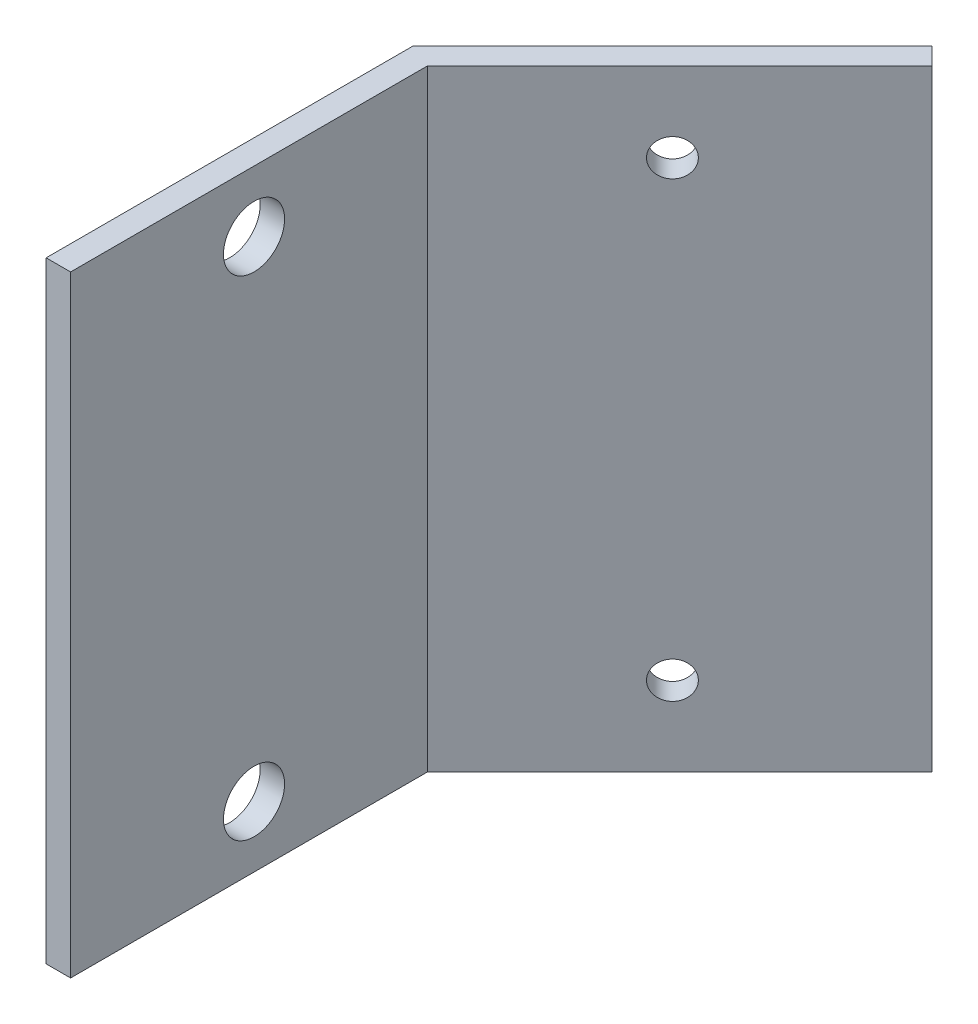
ISO-10303-21;
HEADER;
FILE_DESCRIPTION(('STEP AP214'),'2;1');
FILE_NAME('part.step','',(''),(''),'','','');
FILE_SCHEMA(('AUTOMOTIVE_DESIGN { 1 0 10303 214 1 1 1 1 }'));
ENDSEC;
DATA;
#1=APPLICATION_CONTEXT('core data for automotive mechanical design processes');
#2=APPLICATION_PROTOCOL_DEFINITION('international standard','automotive_design',2000,#1);
#3=PRODUCT_CONTEXT('',#1,'mechanical');
#4=PRODUCT('Part','Part','',(#3));
#5=PRODUCT_RELATED_PRODUCT_CATEGORY('part','',(#4));
#6=PRODUCT_DEFINITION_FORMATION('','',#4);
#7=PRODUCT_DEFINITION_CONTEXT('part definition',#1,'design');
#8=PRODUCT_DEFINITION('design','',#6,#7);
#9=PRODUCT_DEFINITION_SHAPE('','',#8);
#10=(LENGTH_UNIT() NAMED_UNIT(*) SI_UNIT(.MILLI.,.METRE.));
#11=(NAMED_UNIT(*) PLANE_ANGLE_UNIT() SI_UNIT($,.RADIAN.));
#12=(NAMED_UNIT(*) SI_UNIT($,.STERADIAN.) SOLID_ANGLE_UNIT());
#13=UNCERTAINTY_MEASURE_WITH_UNIT(LENGTH_MEASURE(1.E-05),#10,'distance_accuracy_value','');
#14=(GEOMETRIC_REPRESENTATION_CONTEXT(3) GLOBAL_UNCERTAINTY_ASSIGNED_CONTEXT((#13)) GLOBAL_UNIT_ASSIGNED_CONTEXT((#10,
#11,#12)) REPRESENTATION_CONTEXT('',''));
#15=CARTESIAN_POINT('',(0.,0.,0.));
#16=DIRECTION('',(0.,0.,1.));
#17=DIRECTION('',(1.,0.,0.));
#18=AXIS2_PLACEMENT_3D('',#15,#16,#17);
#19=CARTESIAN_POINT('',(2.,50.,0.));
#20=DIRECTION('',(0.,0.,-1.));
#21=DIRECTION('',(-1.,0.,0.));
#22=AXIS2_PLACEMENT_3D('',#19,#20,#21);
#23=PLANE('',#22);
#24=DIRECTION('',(1.,0.,0.));
#25=VECTOR('',#24,1.);
#26=CARTESIAN_POINT('',(2.,0.,0.));
#27=LINE('',#26,#25);
#28=CARTESIAN_POINT('',(0.,0.,0.));
#29=VERTEX_POINT('',#28);
#30=CARTESIAN_POINT('',(2.,0.,0.));
#31=VERTEX_POINT('',#30);
#32=EDGE_CURVE('E115',#29,#31,#27,.T.);
#33=ORIENTED_EDGE('',*,*,#32,.T.);
#34=DIRECTION('',(0.,-1.,0.));
#35=VECTOR('',#34,1.);
#36=CARTESIAN_POINT('',(2.,50.,0.));
#37=LINE('',#36,#35);
#38=CARTESIAN_POINT('',(2.,50.,0.));
#39=VERTEX_POINT('',#38);
#40=EDGE_CURVE('E11',#39,#31,#37,.T.);
#41=ORIENTED_EDGE('',*,*,#40,.F.);
#42=DIRECTION('',(1.,0.,0.));
#43=VECTOR('',#42,1.);
#44=CARTESIAN_POINT('',(2.,50.,0.));
#45=LINE('',#44,#43);
#46=CARTESIAN_POINT('',(0.,50.,0.));
#47=VERTEX_POINT('',#46);
#48=EDGE_CURVE('E126',#47,#39,#45,.T.);
#49=ORIENTED_EDGE('',*,*,#48,.F.);
#50=DIRECTION('',(0.,-1.,0.));
#51=VECTOR('',#50,1.);
#52=CARTESIAN_POINT('',(0.,50.,0.));
#53=LINE('',#52,#51);
#54=EDGE_CURVE('E111',#47,#29,#53,.T.);
#55=ORIENTED_EDGE('',*,*,#54,.T.);
#56=EDGE_LOOP('',(#33,#41,#49,#55));
#57=FACE_BOUND('',#56,.T.);
#58=ADVANCED_FACE('F31',(#57),#23,.F.);
#59=CARTESIAN_POINT('',(2.00000000000001,50.,-29.1715728752538));
#60=DIRECTION('',(-1.,0.,0.));
#61=DIRECTION('',(0.,0.,1.));
#62=AXIS2_PLACEMENT_3D('',#59,#60,#61);
#63=PLANE('',#62);
#64=CARTESIAN_POINT('',(2.,45.,-15.));
#65=DIRECTION('',(-1.,0.,0.));
#66=DIRECTION('',(0.,0.,1.));
#67=AXIS2_PLACEMENT_3D('',#64,#65,#66);
#68=CIRCLE('',#67,2.5);
#69=CARTESIAN_POINT('',(2.,45.,-12.5));
#70=VERTEX_POINT('',#69);
#71=EDGE_CURVE('E260',#70,#70,#68,.F.);
#72=ORIENTED_EDGE('',*,*,#71,.F.);
#73=EDGE_LOOP('',(#72));
#74=FACE_BOUND('',#73,.T.);
#75=CARTESIAN_POINT('',(2.,5.,-15.));
#76=DIRECTION('',(-1.,0.,0.));
#77=DIRECTION('',(0.,0.,1.));
#78=AXIS2_PLACEMENT_3D('',#75,#76,#77);
#79=CIRCLE('',#78,2.5);
#80=CARTESIAN_POINT('',(2.,5.,-12.5));
#81=VERTEX_POINT('',#80);
#82=EDGE_CURVE('E119',#81,#81,#79,.F.);
#83=ORIENTED_EDGE('',*,*,#82,.F.);
#84=EDGE_LOOP('',(#83));
#85=FACE_BOUND('',#84,.T.);
#86=DIRECTION('',(0.,0.,-1.));
#87=VECTOR('',#86,1.);
#88=CARTESIAN_POINT('',(2.00000000000001,0.,-29.1715728752538));
#89=LINE('',#88,#87);
#90=CARTESIAN_POINT('',(2.00000000000001,0.,-29.1715728752538));
#91=VERTEX_POINT('',#90);
#92=EDGE_CURVE('E118',#31,#91,#89,.T.);
#93=ORIENTED_EDGE('',*,*,#92,.T.);
#94=DIRECTION('',(0.,-1.,0.));
#95=VECTOR('',#94,1.);
#96=CARTESIAN_POINT('',(2.00000000000001,50.,-29.1715728752538));
#97=LINE('',#96,#95);
#98=CARTESIAN_POINT('',(2.00000000000001,50.,-29.1715728752538));
#99=VERTEX_POINT('',#98);
#100=EDGE_CURVE('E39',#99,#91,#97,.T.);
#101=ORIENTED_EDGE('',*,*,#100,.F.);
#102=DIRECTION('',(0.,0.,-1.));
#103=VECTOR('',#102,1.);
#104=CARTESIAN_POINT('',(2.00000000000001,50.,-29.1715728752538));
#105=LINE('',#104,#103);
#106=EDGE_CURVE('E84',#39,#99,#105,.T.);
#107=ORIENTED_EDGE('',*,*,#106,.F.);
#108=ORIENTED_EDGE('',*,*,#40,.T.);
#109=EDGE_LOOP('',(#93,#101,#107,#108));
#110=FACE_BOUND('',#109,.T.);
#111=ADVANCED_FACE('F154',(#74,#85,#110),#63,.F.);
#112=CARTESIAN_POINT('',(22.6274169979696,50.,-49.7989898732233));
#113=DIRECTION('',(-0.707106781186546,0.,-0.707106781186549));
#114=DIRECTION('',(-0.707106781186549,0.,0.707106781186546));
#115=AXIS2_PLACEMENT_3D('',#112,#113,#114);
#116=PLANE('',#115);
#117=CARTESIAN_POINT('',(12.0208152801713,6.50000000000001,-39.1923881554251));
#118=DIRECTION('',(-0.707106781186546,0.,-0.707106781186549));
#119=DIRECTION('',(-0.707106781186549,0.,0.707106781186546));
#120=AXIS2_PLACEMENT_3D('',#117,#118,#119);
#121=CIRCLE('',#120,1.50000000000001);
#122=CARTESIAN_POINT('',(10.9601551083915,6.50000000000001,-38.1317279836453));
#123=VERTEX_POINT('',#122);
#124=EDGE_CURVE('E276',#123,#123,#121,.F.);
#125=ORIENTED_EDGE('',*,*,#124,.F.);
#126=EDGE_LOOP('',(#125));
#127=FACE_BOUND('',#126,.T.);
#128=CARTESIAN_POINT('',(12.0208152801713,43.5,-39.1923881554251));
#129=DIRECTION('',(-0.707106781186546,0.,-0.707106781186549));
#130=DIRECTION('',(-0.707106781186549,0.,0.707106781186546));
#131=AXIS2_PLACEMENT_3D('',#128,#129,#130);
#132=CIRCLE('',#131,1.50000000000001);
#133=CARTESIAN_POINT('',(10.9601551083915,43.5,-38.1317279836453));
#134=VERTEX_POINT('',#133);
#135=EDGE_CURVE('E270',#134,#134,#132,.F.);
#136=ORIENTED_EDGE('',*,*,#135,.F.);
#137=EDGE_LOOP('',(#136));
#138=FACE_BOUND('',#137,.T.);
#139=DIRECTION('',(0.707106781186549,0.,-0.707106781186546));
#140=VECTOR('',#139,1.);
#141=CARTESIAN_POINT('',(22.6274169979696,0.,-49.7989898732233));
#142=LINE('',#141,#140);
#143=CARTESIAN_POINT('',(22.6274169979696,0.,-49.7989898732233));
#144=VERTEX_POINT('',#143);
#145=EDGE_CURVE('E121',#91,#144,#142,.T.);
#146=ORIENTED_EDGE('',*,*,#145,.T.);
#147=DIRECTION('',(0.,-1.,0.));
#148=VECTOR('',#147,1.);
#149=CARTESIAN_POINT('',(22.6274169979696,50.,-49.7989898732233));
#150=LINE('',#149,#148);
#151=CARTESIAN_POINT('',(22.6274169979696,50.,-49.7989898732233));
#152=VERTEX_POINT('',#151);
#153=EDGE_CURVE('E106',#152,#144,#150,.T.);
#154=ORIENTED_EDGE('',*,*,#153,.F.);
#155=DIRECTION('',(0.707106781186549,0.,-0.707106781186546));
#156=VECTOR('',#155,1.);
#157=CARTESIAN_POINT('',(22.6274169979696,50.,-49.7989898732233));
#158=LINE('',#157,#156);
#159=EDGE_CURVE('E97',#99,#152,#158,.T.);
#160=ORIENTED_EDGE('',*,*,#159,.F.);
#161=ORIENTED_EDGE('',*,*,#100,.T.);
#162=EDGE_LOOP('',(#146,#154,#160,#161));
#163=FACE_BOUND('',#162,.T.);
#164=ADVANCED_FACE('F132',(#127,#138,#163),#116,.F.);
#165=CARTESIAN_POINT('',(21.2132034355965,50.,-51.2132034355964));
#166=DIRECTION('',(-0.707106781186549,0.,0.707106781186546));
#167=DIRECTION('',(0.707106781186546,0.,0.707106781186549));
#168=AXIS2_PLACEMENT_3D('',#165,#166,#167);
#169=PLANE('',#168);
#170=DIRECTION('',(-0.707106781186546,0.,-0.707106781186549));
#171=VECTOR('',#170,1.);
#172=CARTESIAN_POINT('',(21.2132034355965,0.,-51.2132034355964));
#173=LINE('',#172,#171);
#174=CARTESIAN_POINT('',(21.2132034355965,0.,-51.2132034355964));
#175=VERTEX_POINT('',#174);
#176=EDGE_CURVE('E105',#144,#175,#173,.T.);
#177=ORIENTED_EDGE('',*,*,#176,.T.);
#178=DIRECTION('',(0.,-1.,0.));
#179=VECTOR('',#178,1.);
#180=CARTESIAN_POINT('',(21.2132034355965,50.,-51.2132034355964));
#181=LINE('',#180,#179);
#182=CARTESIAN_POINT('',(21.2132034355965,50.,-51.2132034355964));
#183=VERTEX_POINT('',#182);
#184=EDGE_CURVE('E102',#183,#175,#181,.T.);
#185=ORIENTED_EDGE('',*,*,#184,.F.);
#186=DIRECTION('',(-0.707106781186546,0.,-0.707106781186549));
#187=VECTOR('',#186,1.);
#188=CARTESIAN_POINT('',(21.2132034355965,50.,-51.2132034355964));
#189=LINE('',#188,#187);
#190=EDGE_CURVE('E91',#152,#183,#189,.T.);
#191=ORIENTED_EDGE('',*,*,#190,.F.);
#192=ORIENTED_EDGE('',*,*,#153,.T.);
#193=EDGE_LOOP('',(#177,#185,#191,#192));
#194=FACE_BOUND('',#193,.T.);
#195=ADVANCED_FACE('F103',(#194),#169,.F.);
#196=CARTESIAN_POINT('',(0.,50.,-30.));
#197=DIRECTION('',(0.707106781186546,0.,0.707106781186549));
#198=DIRECTION('',(0.707106781186549,0.,-0.707106781186546));
#199=AXIS2_PLACEMENT_3D('',#196,#197,#198);
#200=PLANE('',#199);
#201=CARTESIAN_POINT('',(10.6066017177982,6.50000000000001,-40.6066017177982));
#202=DIRECTION('',(-0.707106781186546,0.,-0.707106781186549));
#203=DIRECTION('',(0.707106781186549,0.,-0.707106781186546));
#204=AXIS2_PLACEMENT_3D('',#201,#202,#203);
#205=CIRCLE('',#204,1.50000000000001);
#206=CARTESIAN_POINT('',(11.6672618895781,6.50000000000001,-41.667261889578));
#207=VERTEX_POINT('',#206);
#208=EDGE_CURVE('E279',#207,#207,#205,.T.);
#209=ORIENTED_EDGE('',*,*,#208,.F.);
#210=EDGE_LOOP('',(#209));
#211=FACE_BOUND('',#210,.T.);
#212=CARTESIAN_POINT('',(10.6066017177982,43.5,-40.6066017177982));
#213=DIRECTION('',(-0.707106781186546,0.,-0.707106781186549));
#214=DIRECTION('',(-0.707106781186549,0.,0.707106781186546));
#215=AXIS2_PLACEMENT_3D('',#212,#213,#214);
#216=CIRCLE('',#215,1.50000000000001);
#217=CARTESIAN_POINT('',(9.54594154601839,43.5,-39.5459415460184));
#218=VERTEX_POINT('',#217);
#219=EDGE_CURVE('E273',#218,#218,#216,.T.);
#220=ORIENTED_EDGE('',*,*,#219,.F.);
#221=EDGE_LOOP('',(#220));
#222=FACE_BOUND('',#221,.T.);
#223=DIRECTION('',(-0.707106781186549,0.,0.707106781186546));
#224=VECTOR('',#223,1.);
#225=CARTESIAN_POINT('',(0.,0.,-30.));
#226=LINE('',#225,#224);
#227=CARTESIAN_POINT('',(0.,0.,-30.));
#228=VERTEX_POINT('',#227);
#229=EDGE_CURVE('E70',#175,#228,#226,.T.);
#230=ORIENTED_EDGE('',*,*,#229,.T.);
#231=DIRECTION('',(0.,-1.,0.));
#232=VECTOR('',#231,1.);
#233=CARTESIAN_POINT('',(0.,50.,-30.));
#234=LINE('',#233,#232);
#235=CARTESIAN_POINT('',(0.,50.,-30.));
#236=VERTEX_POINT('',#235);
#237=EDGE_CURVE('E107',#236,#228,#234,.T.);
#238=ORIENTED_EDGE('',*,*,#237,.F.);
#239=DIRECTION('',(-0.707106781186549,0.,0.707106781186546));
#240=VECTOR('',#239,1.);
#241=CARTESIAN_POINT('',(0.,50.,-30.));
#242=LINE('',#241,#240);
#243=EDGE_CURVE('E95',#183,#236,#242,.T.);
#244=ORIENTED_EDGE('',*,*,#243,.F.);
#245=ORIENTED_EDGE('',*,*,#184,.T.);
#246=EDGE_LOOP('',(#230,#238,#244,#245));
#247=FACE_BOUND('',#246,.T.);
#248=ADVANCED_FACE('F109',(#211,#222,#247),#200,.F.);
#249=CARTESIAN_POINT('',(0.,50.,0.));
#250=DIRECTION('',(1.,0.,0.));
#251=DIRECTION('',(0.,0.,-1.));
#252=AXIS2_PLACEMENT_3D('',#249,#250,#251);
#253=PLANE('',#252);
#254=CARTESIAN_POINT('',(0.,45.,-15.));
#255=DIRECTION('',(-1.,0.,0.));
#256=DIRECTION('',(0.,0.,-1.));
#257=AXIS2_PLACEMENT_3D('',#254,#255,#256);
#258=CIRCLE('',#257,2.5);
#259=CARTESIAN_POINT('',(0.,45.,-17.5));
#260=VERTEX_POINT('',#259);
#261=EDGE_CURVE('E267',#260,#260,#258,.T.);
#262=ORIENTED_EDGE('',*,*,#261,.F.);
#263=EDGE_LOOP('',(#262));
#264=FACE_BOUND('',#263,.T.);
#265=CARTESIAN_POINT('',(0.,5.,-15.));
#266=DIRECTION('',(-1.,0.,0.));
#267=DIRECTION('',(0.,0.,1.));
#268=AXIS2_PLACEMENT_3D('',#265,#266,#267);
#269=CIRCLE('',#268,2.5);
#270=CARTESIAN_POINT('',(0.,5.,-12.5));
#271=VERTEX_POINT('',#270);
#272=EDGE_CURVE('E256',#271,#271,#269,.T.);
#273=ORIENTED_EDGE('',*,*,#272,.F.);
#274=EDGE_LOOP('',(#273));
#275=FACE_BOUND('',#274,.T.);
#276=DIRECTION('',(0.,0.,1.));
#277=VECTOR('',#276,1.);
#278=CARTESIAN_POINT('',(0.,0.,0.));
#279=LINE('',#278,#277);
#280=EDGE_CURVE('E76',#228,#29,#279,.T.);
#281=ORIENTED_EDGE('',*,*,#280,.T.);
#282=ORIENTED_EDGE('',*,*,#54,.F.);
#283=DIRECTION('',(0.,0.,1.));
#284=VECTOR('',#283,1.);
#285=CARTESIAN_POINT('',(0.,50.,0.));
#286=LINE('',#285,#284);
#287=EDGE_CURVE('E47',#236,#47,#286,.T.);
#288=ORIENTED_EDGE('',*,*,#287,.F.);
#289=ORIENTED_EDGE('',*,*,#237,.T.);
#290=EDGE_LOOP('',(#281,#282,#288,#289));
#291=FACE_BOUND('',#290,.T.);
#292=ADVANCED_FACE('F139',(#264,#275,#291),#253,.F.);
#293=CARTESIAN_POINT('',(0.,50.,0.));
#294=DIRECTION('',(0.,-1.,0.));
#295=DIRECTION('',(0.,0.,-1.));
#296=AXIS2_PLACEMENT_3D('',#293,#294,#295);
#297=PLANE('',#296);
#298=ORIENTED_EDGE('',*,*,#48,.T.);
#299=ORIENTED_EDGE('',*,*,#106,.T.);
#300=ORIENTED_EDGE('',*,*,#159,.T.);
#301=ORIENTED_EDGE('',*,*,#190,.T.);
#302=ORIENTED_EDGE('',*,*,#243,.T.);
#303=ORIENTED_EDGE('',*,*,#287,.T.);
#304=EDGE_LOOP('',(#298,#299,#300,#301,#302,#303));
#305=FACE_BOUND('',#304,.T.);
#306=ADVANCED_FACE('F93',(#305),#297,.F.);
#307=CARTESIAN_POINT('',(0.,0.,0.));
#308=DIRECTION('',(0.,-1.,0.));
#309=DIRECTION('',(0.,0.,-1.));
#310=AXIS2_PLACEMENT_3D('',#307,#308,#309);
#311=PLANE('',#310);
#312=ORIENTED_EDGE('',*,*,#32,.F.);
#313=ORIENTED_EDGE('',*,*,#280,.F.);
#314=ORIENTED_EDGE('',*,*,#229,.F.);
#315=ORIENTED_EDGE('',*,*,#176,.F.);
#316=ORIENTED_EDGE('',*,*,#145,.F.);
#317=ORIENTED_EDGE('',*,*,#92,.F.);
#318=EDGE_LOOP('',(#312,#313,#314,#315,#316,#317));
#319=FACE_BOUND('',#318,.T.);
#320=ADVANCED_FACE('F135',(#319),#311,.T.);
#321=CARTESIAN_POINT('',(22.6284169979696,5.,-15.));
#322=DIRECTION('',(-1.,0.,0.));
#323=DIRECTION('',(0.,0.,1.));
#324=AXIS2_PLACEMENT_3D('',#321,#322,#323);
#325=CYLINDRICAL_SURFACE('',#324,2.5);
#326=ORIENTED_EDGE('',*,*,#272,.T.);
#327=EDGE_LOOP('',(#326));
#328=FACE_BOUND('',#327,.T.);
#329=ORIENTED_EDGE('',*,*,#82,.T.);
#330=EDGE_LOOP('',(#329));
#331=FACE_BOUND('',#330,.T.);
#332=ADVANCED_FACE('F212',(#328,#331),#325,.F.);
#333=CARTESIAN_POINT('',(22.6284169979696,45.,-15.));
#334=DIRECTION('',(-1.,0.,0.));
#335=DIRECTION('',(0.,0.,1.));
#336=AXIS2_PLACEMENT_3D('',#333,#334,#335);
#337=CYLINDRICAL_SURFACE('',#336,2.5);
#338=ORIENTED_EDGE('',*,*,#261,.T.);
#339=EDGE_LOOP('',(#338));
#340=FACE_BOUND('',#339,.T.);
#341=ORIENTED_EDGE('',*,*,#71,.T.);
#342=EDGE_LOOP('',(#341));
#343=FACE_BOUND('',#342,.T.);
#344=ADVANCED_FACE('F192',(#340,#343),#337,.F.);
#345=CARTESIAN_POINT('',(36.921310216783,43.5,-14.2918932188134));
#346=DIRECTION('',(-0.707106781186546,0.,-0.707106781186549));
#347=DIRECTION('',(-0.707106781186549,0.,0.707106781186546));
#348=AXIS2_PLACEMENT_3D('',#345,#346,#347);
#349=CYLINDRICAL_SURFACE('',#348,1.50000000000001);
#350=ORIENTED_EDGE('',*,*,#219,.T.);
#351=EDGE_LOOP('',(#350));
#352=FACE_BOUND('',#351,.T.);
#353=ORIENTED_EDGE('',*,*,#135,.T.);
#354=EDGE_LOOP('',(#353));
#355=FACE_BOUND('',#354,.T.);
#356=ADVANCED_FACE('F186',(#352,#355),#349,.F.);
#357=CARTESIAN_POINT('',(36.921310216783,6.50000000000001,-14.2918932188134));
#358=DIRECTION('',(-0.707106781186546,0.,-0.707106781186549));
#359=DIRECTION('',(-0.707106781186549,0.,0.707106781186546));
#360=AXIS2_PLACEMENT_3D('',#357,#358,#359);
#361=CYLINDRICAL_SURFACE('',#360,1.50000000000001);
#362=ORIENTED_EDGE('',*,*,#208,.T.);
#363=EDGE_LOOP('',(#362));
#364=FACE_BOUND('',#363,.T.);
#365=ORIENTED_EDGE('',*,*,#124,.T.);
#366=EDGE_LOOP('',(#365));
#367=FACE_BOUND('',#366,.T.);
#368=ADVANCED_FACE('F191',(#364,#367),#361,.F.);
#369=CLOSED_SHELL('',(#58,#111,#164,#195,#248,#292,#306,#320,#332,#344,#356,#368));
#370=MANIFOLD_SOLID_BREP('B2',#369);
#371=ADVANCED_BREP_SHAPE_REPRESENTATION('',(#18,#370),#14);
#372=SHAPE_DEFINITION_REPRESENTATION(#9,#371);
ENDSEC;
END-ISO-10303-21;
